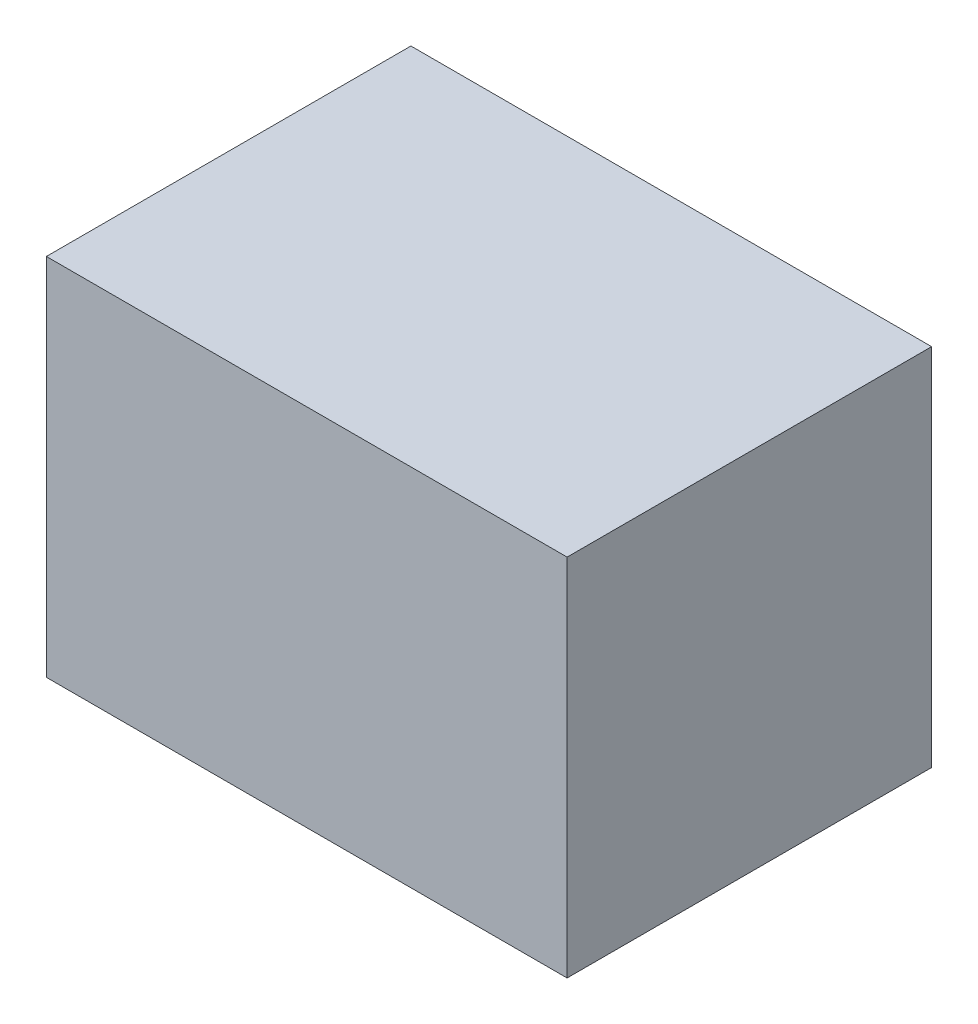
ISO-10303-21;
HEADER;
FILE_DESCRIPTION(('STEP AP214'),'2;1');
FILE_NAME('part.step','',(''),(''),'','','');
FILE_SCHEMA(('AUTOMOTIVE_DESIGN { 1 0 10303 214 1 1 1 1 }'));
ENDSEC;
DATA;
#1=APPLICATION_CONTEXT('core data for automotive mechanical design processes');
#2=APPLICATION_PROTOCOL_DEFINITION('international standard','automotive_design',2000,#1);
#3=PRODUCT_CONTEXT('',#1,'mechanical');
#4=PRODUCT('Part','Part','',(#3));
#5=PRODUCT_RELATED_PRODUCT_CATEGORY('part','',(#4));
#6=PRODUCT_DEFINITION_FORMATION('','',#4);
#7=PRODUCT_DEFINITION_CONTEXT('part definition',#1,'design');
#8=PRODUCT_DEFINITION('design','',#6,#7);
#9=PRODUCT_DEFINITION_SHAPE('','',#8);
#10=(LENGTH_UNIT() NAMED_UNIT(*) SI_UNIT(.MILLI.,.METRE.));
#11=(NAMED_UNIT(*) PLANE_ANGLE_UNIT() SI_UNIT($,.RADIAN.));
#12=(NAMED_UNIT(*) SI_UNIT($,.STERADIAN.) SOLID_ANGLE_UNIT());
#13=UNCERTAINTY_MEASURE_WITH_UNIT(LENGTH_MEASURE(1.E-05),#10,'distance_accuracy_value','');
#14=(GEOMETRIC_REPRESENTATION_CONTEXT(3) GLOBAL_UNCERTAINTY_ASSIGNED_CONTEXT((#13)) GLOBAL_UNIT_ASSIGNED_CONTEXT((#10,
#11,#12)) REPRESENTATION_CONTEXT('',''));
#15=CARTESIAN_POINT('',(0.,0.,0.));
#16=DIRECTION('',(0.,0.,1.));
#17=DIRECTION('',(1.,0.,0.));
#18=AXIS2_PLACEMENT_3D('',#15,#16,#17);
#19=CARTESIAN_POINT('',(-5.08,0.,0.));
#20=DIRECTION('',(0.,1.,0.));
#21=DIRECTION('',(1.,0.,0.));
#22=AXIS2_PLACEMENT_3D('',#19,#20,#21);
#23=PLANE('',#22);
#24=DIRECTION('',(0.,0.,1.));
#25=VECTOR('',#24,1.);
#26=CARTESIAN_POINT('',(9.91,0.,0.749999999999982));
#27=LINE('',#26,#25);
#28=CARTESIAN_POINT('',(9.91,0.,0.749999999999982));
#29=VERTEX_POINT('',#28);
#30=CARTESIAN_POINT('',(9.91,0.,1.1));
#31=VERTEX_POINT('',#30);
#32=EDGE_CURVE('E80',#29,#31,#27,.T.);
#33=ORIENTED_EDGE('',*,*,#32,.T.);
#34=DIRECTION('',(1.,0.,0.));
#35=VECTOR('',#34,1.);
#36=CARTESIAN_POINT('',(9.91,0.,1.1));
#37=LINE('',#36,#35);
#38=CARTESIAN_POINT('',(10.41,0.,1.1));
#39=VERTEX_POINT('',#38);
#40=EDGE_CURVE('E20',#31,#39,#37,.T.);
#41=ORIENTED_EDGE('',*,*,#40,.T.);
#42=DIRECTION('',(0.,0.,1.));
#43=VECTOR('',#42,1.);
#44=CARTESIAN_POINT('',(10.41,0.,0.749999999999982));
#45=LINE('',#44,#43);
#46=CARTESIAN_POINT('',(10.41,0.,0.749999999999982));
#47=VERTEX_POINT('',#46);
#48=EDGE_CURVE('E98',#47,#39,#45,.T.);
#49=ORIENTED_EDGE('',*,*,#48,.F.);
#50=DIRECTION('',(1.,0.,0.));
#51=VECTOR('',#50,1.);
#52=CARTESIAN_POINT('',(9.91,0.,0.749999999999982));
#53=LINE('',#52,#51);
#54=EDGE_CURVE('E61',#29,#47,#53,.T.);
#55=ORIENTED_EDGE('',*,*,#54,.F.);
#56=EDGE_LOOP('',(#33,#41,#49,#55));
#57=FACE_BOUND('',#56,.T.);
#58=ADVANCED_FACE('F16',(#57),#23,.T.);
#59=CARTESIAN_POINT('',(-5.08,-0.35,0.));
#60=DIRECTION('',(0.,1.,0.));
#61=DIRECTION('',(1.,0.,0.));
#62=AXIS2_PLACEMENT_3D('',#59,#60,#61);
#63=PLANE('',#62);
#64=DIRECTION('',(0.,0.,1.));
#65=VECTOR('',#64,1.);
#66=CARTESIAN_POINT('',(9.91,-0.35,0.749999999999982));
#67=LINE('',#66,#65);
#68=CARTESIAN_POINT('',(9.91,-0.35,0.749999999999982));
#69=VERTEX_POINT('',#68);
#70=CARTESIAN_POINT('',(9.91,-0.35,1.1));
#71=VERTEX_POINT('',#70);
#72=EDGE_CURVE('E82',#69,#71,#67,.T.);
#73=ORIENTED_EDGE('',*,*,#72,.F.);
#74=DIRECTION('',(1.,0.,0.));
#75=VECTOR('',#74,1.);
#76=CARTESIAN_POINT('',(9.91,-0.35,0.749999999999982));
#77=LINE('',#76,#75);
#78=CARTESIAN_POINT('',(10.41,-0.35,0.749999999999982));
#79=VERTEX_POINT('',#78);
#80=EDGE_CURVE('E96',#69,#79,#77,.T.);
#81=ORIENTED_EDGE('',*,*,#80,.T.);
#82=DIRECTION('',(0.,0.,1.));
#83=VECTOR('',#82,1.);
#84=CARTESIAN_POINT('',(10.41,-0.35,0.749999999999982));
#85=LINE('',#84,#83);
#86=CARTESIAN_POINT('',(10.41,-0.35,1.1));
#87=VERTEX_POINT('',#86);
#88=EDGE_CURVE('E75',#79,#87,#85,.T.);
#89=ORIENTED_EDGE('',*,*,#88,.T.);
#90=DIRECTION('',(1.,0.,0.));
#91=VECTOR('',#90,1.);
#92=CARTESIAN_POINT('',(9.91,-0.35,1.1));
#93=LINE('',#92,#91);
#94=EDGE_CURVE('E11',#71,#87,#93,.T.);
#95=ORIENTED_EDGE('',*,*,#94,.F.);
#96=EDGE_LOOP('',(#73,#81,#89,#95));
#97=FACE_BOUND('',#96,.T.);
#98=ADVANCED_FACE('F117',(#97),#63,.F.);
#99=CARTESIAN_POINT('',(9.91,-0.35,1.1));
#100=DIRECTION('',(0.,0.,1.));
#101=DIRECTION('',(1.,0.,0.));
#102=AXIS2_PLACEMENT_3D('',#99,#100,#101);
#103=PLANE('',#102);
#104=ORIENTED_EDGE('',*,*,#40,.F.);
#105=DIRECTION('',(0.,1.,0.));
#106=VECTOR('',#105,1.);
#107=CARTESIAN_POINT('',(9.91,-0.35,1.1));
#108=LINE('',#107,#106);
#109=EDGE_CURVE('E69',#71,#31,#108,.T.);
#110=ORIENTED_EDGE('',*,*,#109,.F.);
#111=ORIENTED_EDGE('',*,*,#94,.T.);
#112=DIRECTION('',(0.,1.,0.));
#113=VECTOR('',#112,1.);
#114=CARTESIAN_POINT('',(10.41,-0.35,1.1));
#115=LINE('',#114,#113);
#116=EDGE_CURVE('E72',#87,#39,#115,.T.);
#117=ORIENTED_EDGE('',*,*,#116,.T.);
#118=EDGE_LOOP('',(#104,#110,#111,#117));
#119=FACE_BOUND('',#118,.T.);
#120=ADVANCED_FACE('F68',(#119),#103,.T.);
#121=CARTESIAN_POINT('',(10.41,-0.35,0.749999999999982));
#122=DIRECTION('',(-1.,0.,0.));
#123=DIRECTION('',(0.,0.,1.));
#124=AXIS2_PLACEMENT_3D('',#121,#122,#123);
#125=PLANE('',#124);
#126=ORIENTED_EDGE('',*,*,#48,.T.);
#127=ORIENTED_EDGE('',*,*,#116,.F.);
#128=ORIENTED_EDGE('',*,*,#88,.F.);
#129=DIRECTION('',(0.,1.,0.));
#130=VECTOR('',#129,1.);
#131=CARTESIAN_POINT('',(10.41,-0.35,0.749999999999982));
#132=LINE('',#131,#130);
#133=EDGE_CURVE('E99',#79,#47,#132,.T.);
#134=ORIENTED_EDGE('',*,*,#133,.T.);
#135=EDGE_LOOP('',(#126,#127,#128,#134));
#136=FACE_BOUND('',#135,.T.);
#137=ADVANCED_FACE('F18',(#136),#125,.F.);
#138=CARTESIAN_POINT('',(9.91,-0.35,0.749999999999982));
#139=DIRECTION('',(0.,0.,1.));
#140=DIRECTION('',(1.,0.,0.));
#141=AXIS2_PLACEMENT_3D('',#138,#139,#140);
#142=PLANE('',#141);
#143=ORIENTED_EDGE('',*,*,#54,.T.);
#144=ORIENTED_EDGE('',*,*,#133,.F.);
#145=ORIENTED_EDGE('',*,*,#80,.F.);
#146=DIRECTION('',(0.,1.,0.));
#147=VECTOR('',#146,1.);
#148=CARTESIAN_POINT('',(9.91,-0.35,0.749999999999982));
#149=LINE('',#148,#147);
#150=EDGE_CURVE('E86',#69,#29,#149,.T.);
#151=ORIENTED_EDGE('',*,*,#150,.T.);
#152=EDGE_LOOP('',(#143,#144,#145,#151));
#153=FACE_BOUND('',#152,.T.);
#154=ADVANCED_FACE('F121',(#153),#142,.F.);
#155=CARTESIAN_POINT('',(9.91,-0.35,0.749999999999982));
#156=DIRECTION('',(-1.,0.,0.));
#157=DIRECTION('',(0.,0.,1.));
#158=AXIS2_PLACEMENT_3D('',#155,#156,#157);
#159=PLANE('',#158);
#160=ORIENTED_EDGE('',*,*,#32,.F.);
#161=ORIENTED_EDGE('',*,*,#150,.F.);
#162=ORIENTED_EDGE('',*,*,#72,.T.);
#163=ORIENTED_EDGE('',*,*,#109,.T.);
#164=EDGE_LOOP('',(#160,#161,#162,#163));
#165=FACE_BOUND('',#164,.T.);
#166=ADVANCED_FACE('F78',(#165),#159,.T.);
#167=CLOSED_SHELL('',(#58,#98,#120,#137,#154,#166));
#168=MANIFOLD_SOLID_BREP('B1',#167);
#169=ADVANCED_BREP_SHAPE_REPRESENTATION('',(#18,#168),#14);
#170=SHAPE_DEFINITION_REPRESENTATION(#9,#169);
ENDSEC;
END-ISO-10303-21;
